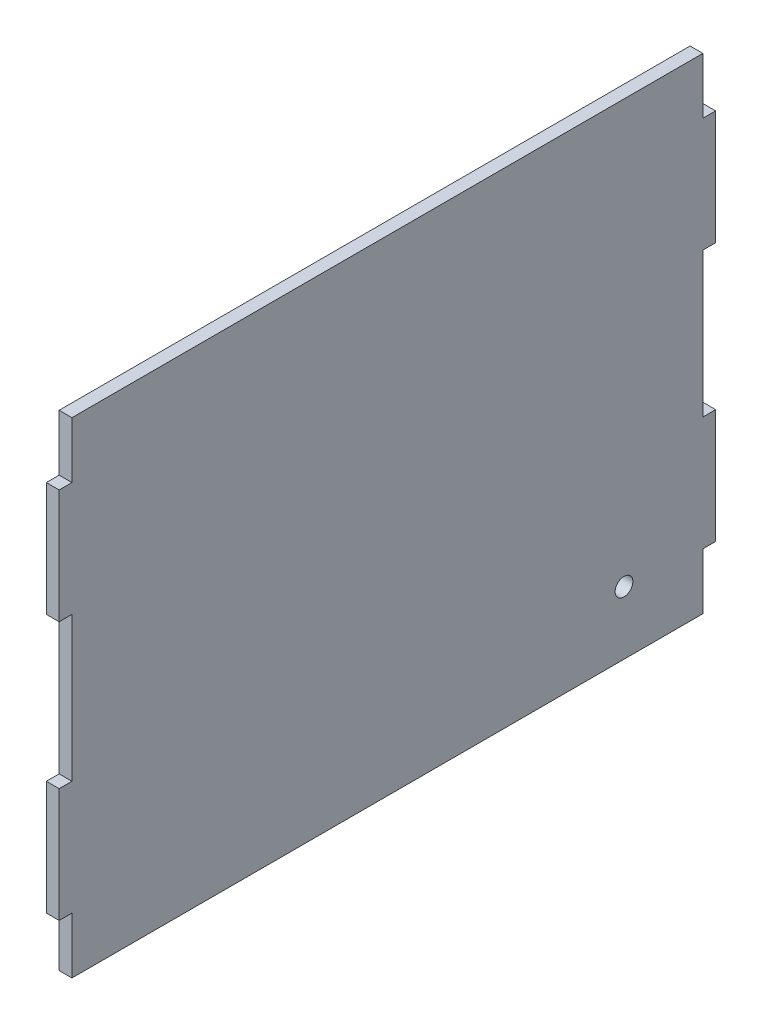
ISO-10303-21;
HEADER;
FILE_DESCRIPTION(('STEP AP214'),'2;1');
FILE_NAME('part.step','',(''),(''),'','','');
FILE_SCHEMA(('AUTOMOTIVE_DESIGN { 1 0 10303 214 1 1 1 1 }'));
ENDSEC;
DATA;
#1=APPLICATION_CONTEXT('core data for automotive mechanical design processes');
#2=APPLICATION_PROTOCOL_DEFINITION('international standard','automotive_design',2000,#1);
#3=PRODUCT_CONTEXT('',#1,'mechanical');
#4=PRODUCT('Part','Part','',(#3));
#5=PRODUCT_RELATED_PRODUCT_CATEGORY('part','',(#4));
#6=PRODUCT_DEFINITION_FORMATION('','',#4);
#7=PRODUCT_DEFINITION_CONTEXT('part definition',#1,'design');
#8=PRODUCT_DEFINITION('design','',#6,#7);
#9=PRODUCT_DEFINITION_SHAPE('','',#8);
#10=(LENGTH_UNIT() NAMED_UNIT(*) SI_UNIT(.MILLI.,.METRE.));
#11=(NAMED_UNIT(*) PLANE_ANGLE_UNIT() SI_UNIT($,.RADIAN.));
#12=(NAMED_UNIT(*) SI_UNIT($,.STERADIAN.) SOLID_ANGLE_UNIT());
#13=UNCERTAINTY_MEASURE_WITH_UNIT(LENGTH_MEASURE(1.E-05),#10,'distance_accuracy_value','');
#14=(GEOMETRIC_REPRESENTATION_CONTEXT(3) GLOBAL_UNCERTAINTY_ASSIGNED_CONTEXT((#13)) GLOBAL_UNIT_ASSIGNED_CONTEXT((#10,
#11,#12)) REPRESENTATION_CONTEXT('',''));
#15=CARTESIAN_POINT('',(0.,0.,0.));
#16=DIRECTION('',(0.,0.,1.));
#17=DIRECTION('',(1.,0.,0.));
#18=AXIS2_PLACEMENT_3D('',#15,#16,#17);
#19=CARTESIAN_POINT('',(5.7,-32.1500000000001,-140.35));
#20=DIRECTION('',(0.,-1.,0.));
#21=DIRECTION('',(0.,0.,-1.));
#22=AXIS2_PLACEMENT_3D('',#19,#20,#21);
#23=PLANE('',#22);
#24=DIRECTION('',(0.,0.,1.));
#25=VECTOR('',#24,1.);
#26=CARTESIAN_POINT('',(0.,-32.1500000000001,-140.35));
#27=LINE('',#26,#25);
#28=CARTESIAN_POINT('',(0.,-32.1500000000001,-146.05));
#29=VERTEX_POINT('',#28);
#30=CARTESIAN_POINT('',(0.,-32.1500000000001,-140.35));
#31=VERTEX_POINT('',#30);
#32=EDGE_CURVE('E216',#29,#31,#27,.T.);
#33=ORIENTED_EDGE('',*,*,#32,.T.);
#34=DIRECTION('',(-1.,0.,0.));
#35=VECTOR('',#34,1.);
#36=CARTESIAN_POINT('',(5.7,-32.1500000000001,-140.35));
#37=LINE('',#36,#35);
#38=CARTESIAN_POINT('',(5.7,-32.1500000000001,-140.35));
#39=VERTEX_POINT('',#38);
#40=EDGE_CURVE('E11',#39,#31,#37,.T.);
#41=ORIENTED_EDGE('',*,*,#40,.F.);
#42=DIRECTION('',(0.,0.,1.));
#43=VECTOR('',#42,1.);
#44=CARTESIAN_POINT('',(5.7,-32.1500000000001,-140.35));
#45=LINE('',#44,#43);
#46=CARTESIAN_POINT('',(5.7,-32.1500000000001,-146.05));
#47=VERTEX_POINT('',#46);
#48=EDGE_CURVE('E274',#47,#39,#45,.T.);
#49=ORIENTED_EDGE('',*,*,#48,.F.);
#50=DIRECTION('',(-1.,0.,0.));
#51=VECTOR('',#50,1.);
#52=CARTESIAN_POINT('',(5.7,-32.1500000000001,-146.05));
#53=LINE('',#52,#51);
#54=EDGE_CURVE('E212',#47,#29,#53,.T.);
#55=ORIENTED_EDGE('',*,*,#54,.T.);
#56=EDGE_LOOP('',(#33,#41,#49,#55));
#57=FACE_BOUND('',#56,.T.);
#58=ADVANCED_FACE('F42',(#57),#23,.F.);
#59=CARTESIAN_POINT('',(5.7,32.15,-140.35));
#60=DIRECTION('',(0.,0.,1.));
#61=DIRECTION('',(1.,0.,0.));
#62=AXIS2_PLACEMENT_3D('',#59,#60,#61);
#63=PLANE('',#62);
#64=DIRECTION('',(0.,1.,0.));
#65=VECTOR('',#64,1.);
#66=CARTESIAN_POINT('',(0.,32.15,-140.35));
#67=LINE('',#66,#65);
#68=CARTESIAN_POINT('',(0.,32.15,-140.35));
#69=VERTEX_POINT('',#68);
#70=EDGE_CURVE('E220',#31,#69,#67,.T.);
#71=ORIENTED_EDGE('',*,*,#70,.T.);
#72=DIRECTION('',(-1.,0.,0.));
#73=VECTOR('',#72,1.);
#74=CARTESIAN_POINT('',(5.7,32.15,-140.35));
#75=LINE('',#74,#73);
#76=CARTESIAN_POINT('',(5.7,32.15,-140.35));
#77=VERTEX_POINT('',#76);
#78=EDGE_CURVE('E52',#77,#69,#75,.T.);
#79=ORIENTED_EDGE('',*,*,#78,.F.);
#80=DIRECTION('',(0.,1.,0.));
#81=VECTOR('',#80,1.);
#82=CARTESIAN_POINT('',(5.7,32.15,-140.35));
#83=LINE('',#82,#81);
#84=EDGE_CURVE('E139',#39,#77,#83,.T.);
#85=ORIENTED_EDGE('',*,*,#84,.F.);
#86=ORIENTED_EDGE('',*,*,#40,.T.);
#87=EDGE_LOOP('',(#71,#79,#85,#86));
#88=FACE_BOUND('',#87,.T.);
#89=ADVANCED_FACE('F427',(#88),#63,.F.);
#90=CARTESIAN_POINT('',(5.7,32.15,-140.35));
#91=DIRECTION('',(0.,1.,0.));
#92=DIRECTION('',(0.,0.,1.));
#93=AXIS2_PLACEMENT_3D('',#90,#91,#92);
#94=PLANE('',#93);
#95=DIRECTION('',(0.,0.,-1.));
#96=VECTOR('',#95,1.);
#97=CARTESIAN_POINT('',(0.,32.15,-140.35));
#98=LINE('',#97,#96);
#99=CARTESIAN_POINT('',(0.,32.15,-146.05));
#100=VERTEX_POINT('',#99);
#101=EDGE_CURVE('E223',#69,#100,#98,.T.);
#102=ORIENTED_EDGE('',*,*,#101,.T.);
#103=DIRECTION('',(-1.,0.,0.));
#104=VECTOR('',#103,1.);
#105=CARTESIAN_POINT('',(5.7,32.15,-146.05));
#106=LINE('',#105,#104);
#107=CARTESIAN_POINT('',(5.7,32.15,-146.05));
#108=VERTEX_POINT('',#107);
#109=EDGE_CURVE('E333',#108,#100,#106,.T.);
#110=ORIENTED_EDGE('',*,*,#109,.F.);
#111=DIRECTION('',(0.,0.,-1.));
#112=VECTOR('',#111,1.);
#113=CARTESIAN_POINT('',(5.7,32.15,-140.35));
#114=LINE('',#113,#112);
#115=EDGE_CURVE('E344',#77,#108,#114,.T.);
#116=ORIENTED_EDGE('',*,*,#115,.F.);
#117=ORIENTED_EDGE('',*,*,#78,.T.);
#118=EDGE_LOOP('',(#102,#110,#116,#117));
#119=FACE_BOUND('',#118,.T.);
#120=ADVANCED_FACE('F342',(#119),#94,.F.);
#121=CARTESIAN_POINT('',(5.7,82.9499999999999,-146.05));
#122=DIRECTION('',(0.,0.,1.));
#123=DIRECTION('',(0.,-1.,0.));
#124=AXIS2_PLACEMENT_3D('',#121,#122,#123);
#125=PLANE('',#124);
#126=DIRECTION('',(0.,1.,0.));
#127=VECTOR('',#126,1.);
#128=CARTESIAN_POINT('',(0.,82.9499999999999,-146.05));
#129=LINE('',#128,#127);
#130=CARTESIAN_POINT('',(0.,82.9499999999999,-146.05));
#131=VERTEX_POINT('',#130);
#132=EDGE_CURVE('E226',#100,#131,#129,.T.);
#133=ORIENTED_EDGE('',*,*,#132,.T.);
#134=DIRECTION('',(-1.,0.,0.));
#135=VECTOR('',#134,1.);
#136=CARTESIAN_POINT('',(5.7,82.9499999999999,-146.05));
#137=LINE('',#136,#135);
#138=CARTESIAN_POINT('',(5.7,82.9499999999999,-146.05));
#139=VERTEX_POINT('',#138);
#140=EDGE_CURVE('E329',#139,#131,#137,.T.);
#141=ORIENTED_EDGE('',*,*,#140,.F.);
#142=DIRECTION('',(0.,1.,0.));
#143=VECTOR('',#142,1.);
#144=CARTESIAN_POINT('',(5.7,82.9499999999999,-146.05));
#145=LINE('',#144,#143);
#146=EDGE_CURVE('E363',#108,#139,#145,.T.);
#147=ORIENTED_EDGE('',*,*,#146,.F.);
#148=ORIENTED_EDGE('',*,*,#109,.T.);
#149=EDGE_LOOP('',(#133,#141,#147,#148));
#150=FACE_BOUND('',#149,.T.);
#151=ADVANCED_FACE('F353',(#150),#125,.F.);
#152=CARTESIAN_POINT('',(5.7,82.9499999999999,-146.05));
#153=DIRECTION('',(0.,-1.,0.));
#154=DIRECTION('',(0.,0.,-1.));
#155=AXIS2_PLACEMENT_3D('',#152,#153,#154);
#156=PLANE('',#155);
#157=DIRECTION('',(0.,0.,1.));
#158=VECTOR('',#157,1.);
#159=CARTESIAN_POINT('',(0.,82.9499999999999,-146.05));
#160=LINE('',#159,#158);
#161=CARTESIAN_POINT('',(0.,82.95,-140.35));
#162=VERTEX_POINT('',#161);
#163=EDGE_CURVE('E229',#131,#162,#160,.T.);
#164=ORIENTED_EDGE('',*,*,#163,.T.);
#165=DIRECTION('',(-1.,0.,0.));
#166=VECTOR('',#165,1.);
#167=CARTESIAN_POINT('',(5.7,82.95,-140.35));
#168=LINE('',#167,#166);
#169=CARTESIAN_POINT('',(5.7,82.95,-140.35));
#170=VERTEX_POINT('',#169);
#171=EDGE_CURVE('E325',#170,#162,#168,.T.);
#172=ORIENTED_EDGE('',*,*,#171,.F.);
#173=DIRECTION('',(0.,0.,1.));
#174=VECTOR('',#173,1.);
#175=CARTESIAN_POINT('',(5.7,82.9499999999999,-146.05));
#176=LINE('',#175,#174);
#177=EDGE_CURVE('E359',#139,#170,#176,.T.);
#178=ORIENTED_EDGE('',*,*,#177,.F.);
#179=ORIENTED_EDGE('',*,*,#140,.T.);
#180=EDGE_LOOP('',(#164,#172,#178,#179));
#181=FACE_BOUND('',#180,.T.);
#182=ADVANCED_FACE('F357',(#181),#156,.F.);
#183=CARTESIAN_POINT('',(5.7,82.95,-140.35));
#184=DIRECTION('',(0.,0.,1.));
#185=DIRECTION('',(1.,0.,0.));
#186=AXIS2_PLACEMENT_3D('',#183,#184,#185);
#187=PLANE('',#186);
#188=DIRECTION('',(0.,1.,0.));
#189=VECTOR('',#188,1.);
#190=CARTESIAN_POINT('',(0.,82.95,-140.35));
#191=LINE('',#190,#189);
#192=CARTESIAN_POINT('',(0.,107.95,-140.35));
#193=VERTEX_POINT('',#192);
#194=EDGE_CURVE('E232',#162,#193,#191,.T.);
#195=ORIENTED_EDGE('',*,*,#194,.T.);
#196=DIRECTION('',(-1.,0.,0.));
#197=VECTOR('',#196,1.);
#198=CARTESIAN_POINT('',(5.7,107.95,-140.35));
#199=LINE('',#198,#197);
#200=CARTESIAN_POINT('',(5.7,107.95,-140.35));
#201=VERTEX_POINT('',#200);
#202=EDGE_CURVE('E321',#201,#193,#199,.T.);
#203=ORIENTED_EDGE('',*,*,#202,.F.);
#204=DIRECTION('',(0.,1.,0.));
#205=VECTOR('',#204,1.);
#206=CARTESIAN_POINT('',(5.7,82.95,-140.35));
#207=LINE('',#206,#205);
#208=EDGE_CURVE('E362',#170,#201,#207,.T.);
#209=ORIENTED_EDGE('',*,*,#208,.F.);
#210=ORIENTED_EDGE('',*,*,#171,.T.);
#211=EDGE_LOOP('',(#195,#203,#209,#210));
#212=FACE_BOUND('',#211,.T.);
#213=ADVANCED_FACE('F440',(#212),#187,.F.);
#214=CARTESIAN_POINT('',(5.7,107.95,140.35));
#215=DIRECTION('',(0.,-1.,0.));
#216=DIRECTION('',(0.,0.,-1.));
#217=AXIS2_PLACEMENT_3D('',#214,#215,#216);
#218=PLANE('',#217);
#219=DIRECTION('',(0.,0.,1.));
#220=VECTOR('',#219,1.);
#221=CARTESIAN_POINT('',(0.,107.95,140.35));
#222=LINE('',#221,#220);
#223=CARTESIAN_POINT('',(0.,107.95,140.35));
#224=VERTEX_POINT('',#223);
#225=EDGE_CURVE('E235',#193,#224,#222,.T.);
#226=ORIENTED_EDGE('',*,*,#225,.T.);
#227=DIRECTION('',(-1.,0.,0.));
#228=VECTOR('',#227,1.);
#229=CARTESIAN_POINT('',(5.7,107.95,140.35));
#230=LINE('',#229,#228);
#231=CARTESIAN_POINT('',(5.7,107.95,140.35));
#232=VERTEX_POINT('',#231);
#233=EDGE_CURVE('E317',#232,#224,#230,.T.);
#234=ORIENTED_EDGE('',*,*,#233,.F.);
#235=DIRECTION('',(0.,0.,1.));
#236=VECTOR('',#235,1.);
#237=CARTESIAN_POINT('',(5.7,107.95,140.35));
#238=LINE('',#237,#236);
#239=EDGE_CURVE('E367',#201,#232,#238,.T.);
#240=ORIENTED_EDGE('',*,*,#239,.F.);
#241=ORIENTED_EDGE('',*,*,#202,.T.);
#242=EDGE_LOOP('',(#226,#234,#240,#241));
#243=FACE_BOUND('',#242,.T.);
#244=ADVANCED_FACE('F443',(#243),#218,.F.);
#245=CARTESIAN_POINT('',(5.7,82.95,140.35));
#246=DIRECTION('',(0.,0.,-1.));
#247=DIRECTION('',(-1.,0.,0.));
#248=AXIS2_PLACEMENT_3D('',#245,#246,#247);
#249=PLANE('',#248);
#250=DIRECTION('',(0.,-1.,0.));
#251=VECTOR('',#250,1.);
#252=CARTESIAN_POINT('',(0.,82.95,140.35));
#253=LINE('',#252,#251);
#254=CARTESIAN_POINT('',(0.,82.95,140.35));
#255=VERTEX_POINT('',#254);
#256=EDGE_CURVE('E238',#224,#255,#253,.T.);
#257=ORIENTED_EDGE('',*,*,#256,.T.);
#258=DIRECTION('',(-1.,0.,0.));
#259=VECTOR('',#258,1.);
#260=CARTESIAN_POINT('',(5.7,82.95,140.35));
#261=LINE('',#260,#259);
#262=CARTESIAN_POINT('',(5.7,82.95,140.35));
#263=VERTEX_POINT('',#262);
#264=EDGE_CURVE('E313',#263,#255,#261,.T.);
#265=ORIENTED_EDGE('',*,*,#264,.F.);
#266=DIRECTION('',(0.,-1.,0.));
#267=VECTOR('',#266,1.);
#268=CARTESIAN_POINT('',(5.7,82.95,140.35));
#269=LINE('',#268,#267);
#270=EDGE_CURVE('E374',#232,#263,#269,.T.);
#271=ORIENTED_EDGE('',*,*,#270,.F.);
#272=ORIENTED_EDGE('',*,*,#233,.T.);
#273=EDGE_LOOP('',(#257,#265,#271,#272));
#274=FACE_BOUND('',#273,.T.);
#275=ADVANCED_FACE('F447',(#274),#249,.F.);
#276=CARTESIAN_POINT('',(5.7,82.95,146.05));
#277=DIRECTION('',(0.,-1.,0.));
#278=DIRECTION('',(0.,0.,-1.));
#279=AXIS2_PLACEMENT_3D('',#276,#277,#278);
#280=PLANE('',#279);
#281=DIRECTION('',(0.,0.,1.));
#282=VECTOR('',#281,1.);
#283=CARTESIAN_POINT('',(0.,82.95,146.05));
#284=LINE('',#283,#282);
#285=CARTESIAN_POINT('',(0.,82.95,146.05));
#286=VERTEX_POINT('',#285);
#287=EDGE_CURVE('E241',#255,#286,#284,.T.);
#288=ORIENTED_EDGE('',*,*,#287,.T.);
#289=DIRECTION('',(-1.,0.,0.));
#290=VECTOR('',#289,1.);
#291=CARTESIAN_POINT('',(5.7,82.95,146.05));
#292=LINE('',#291,#290);
#293=CARTESIAN_POINT('',(5.7,82.95,146.05));
#294=VERTEX_POINT('',#293);
#295=EDGE_CURVE('E309',#294,#286,#292,.T.);
#296=ORIENTED_EDGE('',*,*,#295,.F.);
#297=DIRECTION('',(0.,0.,1.));
#298=VECTOR('',#297,1.);
#299=CARTESIAN_POINT('',(5.7,82.95,146.05));
#300=LINE('',#299,#298);
#301=EDGE_CURVE('E377',#263,#294,#300,.T.);
#302=ORIENTED_EDGE('',*,*,#301,.F.);
#303=ORIENTED_EDGE('',*,*,#264,.T.);
#304=EDGE_LOOP('',(#288,#296,#302,#303));
#305=FACE_BOUND('',#304,.T.);
#306=ADVANCED_FACE('F451',(#305),#280,.F.);
#307=CARTESIAN_POINT('',(5.7,82.95,146.05));
#308=DIRECTION('',(0.,0.,-1.));
#309=DIRECTION('',(0.,1.,0.));
#310=AXIS2_PLACEMENT_3D('',#307,#308,#309);
#311=PLANE('',#310);
#312=DIRECTION('',(0.,-1.,0.));
#313=VECTOR('',#312,1.);
#314=CARTESIAN_POINT('',(0.,82.95,146.05));
#315=LINE('',#314,#313);
#316=CARTESIAN_POINT('',(0.,32.15,146.05));
#317=VERTEX_POINT('',#316);
#318=EDGE_CURVE('E244',#286,#317,#315,.T.);
#319=ORIENTED_EDGE('',*,*,#318,.T.);
#320=DIRECTION('',(-1.,0.,0.));
#321=VECTOR('',#320,1.);
#322=CARTESIAN_POINT('',(5.7,32.15,146.05));
#323=LINE('',#322,#321);
#324=CARTESIAN_POINT('',(5.7,32.15,146.05));
#325=VERTEX_POINT('',#324);
#326=EDGE_CURVE('E305',#325,#317,#323,.T.);
#327=ORIENTED_EDGE('',*,*,#326,.F.);
#328=DIRECTION('',(0.,-1.,0.));
#329=VECTOR('',#328,1.);
#330=CARTESIAN_POINT('',(5.7,82.95,146.05));
#331=LINE('',#330,#329);
#332=EDGE_CURVE('E380',#294,#325,#331,.T.);
#333=ORIENTED_EDGE('',*,*,#332,.F.);
#334=ORIENTED_EDGE('',*,*,#295,.T.);
#335=EDGE_LOOP('',(#319,#327,#333,#334));
#336=FACE_BOUND('',#335,.T.);
#337=ADVANCED_FACE('F455',(#336),#311,.F.);
#338=CARTESIAN_POINT('',(5.7,32.15,140.35));
#339=DIRECTION('',(0.,1.,0.));
#340=DIRECTION('',(0.,0.,1.));
#341=AXIS2_PLACEMENT_3D('',#338,#339,#340);
#342=PLANE('',#341);
#343=DIRECTION('',(0.,0.,-1.));
#344=VECTOR('',#343,1.);
#345=CARTESIAN_POINT('',(0.,32.15,140.35));
#346=LINE('',#345,#344);
#347=CARTESIAN_POINT('',(0.,32.15,140.35));
#348=VERTEX_POINT('',#347);
#349=EDGE_CURVE('E247',#317,#348,#346,.T.);
#350=ORIENTED_EDGE('',*,*,#349,.T.);
#351=DIRECTION('',(-1.,0.,0.));
#352=VECTOR('',#351,1.);
#353=CARTESIAN_POINT('',(5.7,32.15,140.35));
#354=LINE('',#353,#352);
#355=CARTESIAN_POINT('',(5.7,32.15,140.35));
#356=VERTEX_POINT('',#355);
#357=EDGE_CURVE('E301',#356,#348,#354,.T.);
#358=ORIENTED_EDGE('',*,*,#357,.F.);
#359=DIRECTION('',(0.,0.,-1.));
#360=VECTOR('',#359,1.);
#361=CARTESIAN_POINT('',(5.7,32.15,140.35));
#362=LINE('',#361,#360);
#363=EDGE_CURVE('E383',#325,#356,#362,.T.);
#364=ORIENTED_EDGE('',*,*,#363,.F.);
#365=ORIENTED_EDGE('',*,*,#326,.T.);
#366=EDGE_LOOP('',(#350,#358,#364,#365));
#367=FACE_BOUND('',#366,.T.);
#368=ADVANCED_FACE('F459',(#367),#342,.F.);
#369=CARTESIAN_POINT('',(5.7,32.15,140.35));
#370=DIRECTION('',(0.,0.,-1.));
#371=DIRECTION('',(-1.,0.,0.));
#372=AXIS2_PLACEMENT_3D('',#369,#370,#371);
#373=PLANE('',#372);
#374=DIRECTION('',(0.,-1.,0.));
#375=VECTOR('',#374,1.);
#376=CARTESIAN_POINT('',(0.,32.15,140.35));
#377=LINE('',#376,#375);
#378=CARTESIAN_POINT('',(0.,-32.15,140.35));
#379=VERTEX_POINT('',#378);
#380=EDGE_CURVE('E250',#348,#379,#377,.T.);
#381=ORIENTED_EDGE('',*,*,#380,.T.);
#382=DIRECTION('',(-1.,0.,0.));
#383=VECTOR('',#382,1.);
#384=CARTESIAN_POINT('',(5.7,-32.15,140.35));
#385=LINE('',#384,#383);
#386=CARTESIAN_POINT('',(5.7,-32.15,140.35));
#387=VERTEX_POINT('',#386);
#388=EDGE_CURVE('E297',#387,#379,#385,.T.);
#389=ORIENTED_EDGE('',*,*,#388,.F.);
#390=DIRECTION('',(0.,-1.,0.));
#391=VECTOR('',#390,1.);
#392=CARTESIAN_POINT('',(5.7,32.15,140.35));
#393=LINE('',#392,#391);
#394=EDGE_CURVE('E386',#356,#387,#393,.T.);
#395=ORIENTED_EDGE('',*,*,#394,.F.);
#396=ORIENTED_EDGE('',*,*,#357,.T.);
#397=EDGE_LOOP('',(#381,#389,#395,#396));
#398=FACE_BOUND('',#397,.T.);
#399=ADVANCED_FACE('F463',(#398),#373,.F.);
#400=CARTESIAN_POINT('',(5.7,-32.15,140.35));
#401=DIRECTION('',(0.,-1.,0.));
#402=DIRECTION('',(0.,0.,-1.));
#403=AXIS2_PLACEMENT_3D('',#400,#401,#402);
#404=PLANE('',#403);
#405=DIRECTION('',(0.,0.,1.));
#406=VECTOR('',#405,1.);
#407=CARTESIAN_POINT('',(0.,-32.15,140.35));
#408=LINE('',#407,#406);
#409=CARTESIAN_POINT('',(0.,-32.15,146.05));
#410=VERTEX_POINT('',#409);
#411=EDGE_CURVE('E253',#379,#410,#408,.T.);
#412=ORIENTED_EDGE('',*,*,#411,.T.);
#413=DIRECTION('',(-1.,0.,0.));
#414=VECTOR('',#413,1.);
#415=CARTESIAN_POINT('',(5.7,-32.15,146.05));
#416=LINE('',#415,#414);
#417=CARTESIAN_POINT('',(5.7,-32.15,146.05));
#418=VERTEX_POINT('',#417);
#419=EDGE_CURVE('E293',#418,#410,#416,.T.);
#420=ORIENTED_EDGE('',*,*,#419,.F.);
#421=DIRECTION('',(0.,0.,1.));
#422=VECTOR('',#421,1.);
#423=CARTESIAN_POINT('',(5.7,-32.15,140.35));
#424=LINE('',#423,#422);
#425=EDGE_CURVE('E389',#387,#418,#424,.T.);
#426=ORIENTED_EDGE('',*,*,#425,.F.);
#427=ORIENTED_EDGE('',*,*,#388,.T.);
#428=EDGE_LOOP('',(#412,#420,#426,#427));
#429=FACE_BOUND('',#428,.T.);
#430=ADVANCED_FACE('F467',(#429),#404,.F.);
#431=CARTESIAN_POINT('',(5.7,-32.15,146.05));
#432=DIRECTION('',(0.,0.,-1.));
#433=DIRECTION('',(0.,1.,0.));
#434=AXIS2_PLACEMENT_3D('',#431,#432,#433);
#435=PLANE('',#434);
#436=DIRECTION('',(0.,-1.,0.));
#437=VECTOR('',#436,1.);
#438=CARTESIAN_POINT('',(0.,-32.15,146.05));
#439=LINE('',#438,#437);
#440=CARTESIAN_POINT('',(0.,-82.95,146.05));
#441=VERTEX_POINT('',#440);
#442=EDGE_CURVE('E256',#410,#441,#439,.T.);
#443=ORIENTED_EDGE('',*,*,#442,.T.);
#444=DIRECTION('',(-1.,0.,0.));
#445=VECTOR('',#444,1.);
#446=CARTESIAN_POINT('',(5.7,-82.95,146.05));
#447=LINE('',#446,#445);
#448=CARTESIAN_POINT('',(5.7,-82.95,146.05));
#449=VERTEX_POINT('',#448);
#450=EDGE_CURVE('E289',#449,#441,#447,.T.);
#451=ORIENTED_EDGE('',*,*,#450,.F.);
#452=DIRECTION('',(0.,-1.,0.));
#453=VECTOR('',#452,1.);
#454=CARTESIAN_POINT('',(5.7,-32.15,146.05));
#455=LINE('',#454,#453);
#456=EDGE_CURVE('E392',#418,#449,#455,.T.);
#457=ORIENTED_EDGE('',*,*,#456,.F.);
#458=ORIENTED_EDGE('',*,*,#419,.T.);
#459=EDGE_LOOP('',(#443,#451,#457,#458));
#460=FACE_BOUND('',#459,.T.);
#461=ADVANCED_FACE('F471',(#460),#435,.F.);
#462=CARTESIAN_POINT('',(5.7,-82.95,146.05));
#463=DIRECTION('',(0.,1.,0.));
#464=DIRECTION('',(0.,0.,1.));
#465=AXIS2_PLACEMENT_3D('',#462,#463,#464);
#466=PLANE('',#465);
#467=DIRECTION('',(0.,0.,-1.));
#468=VECTOR('',#467,1.);
#469=CARTESIAN_POINT('',(0.,-82.95,146.05));
#470=LINE('',#469,#468);
#471=CARTESIAN_POINT('',(0.,-82.95,140.35));
#472=VERTEX_POINT('',#471);
#473=EDGE_CURVE('E259',#441,#472,#470,.T.);
#474=ORIENTED_EDGE('',*,*,#473,.T.);
#475=DIRECTION('',(-1.,0.,0.));
#476=VECTOR('',#475,1.);
#477=CARTESIAN_POINT('',(5.7,-82.95,140.35));
#478=LINE('',#477,#476);
#479=CARTESIAN_POINT('',(5.7,-82.95,140.35));
#480=VERTEX_POINT('',#479);
#481=EDGE_CURVE('E285',#480,#472,#478,.T.);
#482=ORIENTED_EDGE('',*,*,#481,.F.);
#483=DIRECTION('',(0.,0.,-1.));
#484=VECTOR('',#483,1.);
#485=CARTESIAN_POINT('',(5.7,-82.95,146.05));
#486=LINE('',#485,#484);
#487=EDGE_CURVE('E395',#449,#480,#486,.T.);
#488=ORIENTED_EDGE('',*,*,#487,.F.);
#489=ORIENTED_EDGE('',*,*,#450,.T.);
#490=EDGE_LOOP('',(#474,#482,#488,#489));
#491=FACE_BOUND('',#490,.T.);
#492=ADVANCED_FACE('F475',(#491),#466,.F.);
#493=CARTESIAN_POINT('',(5.7,-82.95,140.35));
#494=DIRECTION('',(0.,0.,-1.));
#495=DIRECTION('',(-1.,0.,0.));
#496=AXIS2_PLACEMENT_3D('',#493,#494,#495);
#497=PLANE('',#496);
#498=DIRECTION('',(0.,-1.,0.));
#499=VECTOR('',#498,1.);
#500=CARTESIAN_POINT('',(0.,-82.95,140.35));
#501=LINE('',#500,#499);
#502=CARTESIAN_POINT('',(0.,-107.95,140.35));
#503=VERTEX_POINT('',#502);
#504=EDGE_CURVE('E262',#472,#503,#501,.T.);
#505=ORIENTED_EDGE('',*,*,#504,.T.);
#506=DIRECTION('',(-1.,0.,0.));
#507=VECTOR('',#506,1.);
#508=CARTESIAN_POINT('',(5.7,-107.95,140.35));
#509=LINE('',#508,#507);
#510=CARTESIAN_POINT('',(5.7,-107.95,140.35));
#511=VERTEX_POINT('',#510);
#512=EDGE_CURVE('E281',#511,#503,#509,.T.);
#513=ORIENTED_EDGE('',*,*,#512,.F.);
#514=DIRECTION('',(0.,-1.,0.));
#515=VECTOR('',#514,1.);
#516=CARTESIAN_POINT('',(5.7,-82.95,140.35));
#517=LINE('',#516,#515);
#518=EDGE_CURVE('E398',#480,#511,#517,.T.);
#519=ORIENTED_EDGE('',*,*,#518,.F.);
#520=ORIENTED_EDGE('',*,*,#481,.T.);
#521=EDGE_LOOP('',(#505,#513,#519,#520));
#522=FACE_BOUND('',#521,.T.);
#523=ADVANCED_FACE('F406',(#522),#497,.F.);
#524=CARTESIAN_POINT('',(5.7,-107.95,140.35));
#525=DIRECTION('',(0.,1.,0.));
#526=DIRECTION('',(0.,0.,1.));
#527=AXIS2_PLACEMENT_3D('',#524,#525,#526);
#528=PLANE('',#527);
#529=DIRECTION('',(0.,0.,-1.));
#530=VECTOR('',#529,1.);
#531=CARTESIAN_POINT('',(0.,-107.95,140.35));
#532=LINE('',#531,#530);
#533=CARTESIAN_POINT('',(0.,-107.95,-140.35));
#534=VERTEX_POINT('',#533);
#535=EDGE_CURVE('E265',#503,#534,#532,.T.);
#536=ORIENTED_EDGE('',*,*,#535,.T.);
#537=DIRECTION('',(-1.,0.,0.));
#538=VECTOR('',#537,1.);
#539=CARTESIAN_POINT('',(5.7,-107.95,-140.35));
#540=LINE('',#539,#538);
#541=CARTESIAN_POINT('',(5.7,-107.95,-140.35));
#542=VERTEX_POINT('',#541);
#543=EDGE_CURVE('E205',#542,#534,#540,.T.);
#544=ORIENTED_EDGE('',*,*,#543,.F.);
#545=DIRECTION('',(0.,0.,-1.));
#546=VECTOR('',#545,1.);
#547=CARTESIAN_POINT('',(5.7,-107.95,140.35));
#548=LINE('',#547,#546);
#549=EDGE_CURVE('E194',#511,#542,#548,.T.);
#550=ORIENTED_EDGE('',*,*,#549,.F.);
#551=ORIENTED_EDGE('',*,*,#512,.T.);
#552=EDGE_LOOP('',(#536,#544,#550,#551));
#553=FACE_BOUND('',#552,.T.);
#554=ADVANCED_FACE('F410',(#553),#528,.F.);
#555=CARTESIAN_POINT('',(5.7,-82.9500000000001,-140.35));
#556=DIRECTION('',(0.,0.,1.));
#557=DIRECTION('',(1.,0.,0.));
#558=AXIS2_PLACEMENT_3D('',#555,#556,#557);
#559=PLANE('',#558);
#560=DIRECTION('',(0.,1.,0.));
#561=VECTOR('',#560,1.);
#562=CARTESIAN_POINT('',(0.,-82.9500000000001,-140.35));
#563=LINE('',#562,#561);
#564=CARTESIAN_POINT('',(0.,-82.9500000000001,-140.35));
#565=VERTEX_POINT('',#564);
#566=EDGE_CURVE('E203',#534,#565,#563,.T.);
#567=ORIENTED_EDGE('',*,*,#566,.T.);
#568=DIRECTION('',(-1.,0.,0.));
#569=VECTOR('',#568,1.);
#570=CARTESIAN_POINT('',(5.7,-82.9500000000001,-140.35));
#571=LINE('',#570,#569);
#572=CARTESIAN_POINT('',(5.7,-82.9500000000001,-140.35));
#573=VERTEX_POINT('',#572);
#574=EDGE_CURVE('E200',#573,#565,#571,.T.);
#575=ORIENTED_EDGE('',*,*,#574,.F.);
#576=DIRECTION('',(0.,1.,0.));
#577=VECTOR('',#576,1.);
#578=CARTESIAN_POINT('',(5.7,-82.9500000000001,-140.35));
#579=LINE('',#578,#577);
#580=EDGE_CURVE('E188',#542,#573,#579,.T.);
#581=ORIENTED_EDGE('',*,*,#580,.F.);
#582=ORIENTED_EDGE('',*,*,#543,.T.);
#583=EDGE_LOOP('',(#567,#575,#581,#582));
#584=FACE_BOUND('',#583,.T.);
#585=ADVANCED_FACE('F201',(#584),#559,.F.);
#586=CARTESIAN_POINT('',(5.7,-82.9500000000001,-146.05));
#587=DIRECTION('',(0.,1.,0.));
#588=DIRECTION('',(0.,0.,1.));
#589=AXIS2_PLACEMENT_3D('',#586,#587,#588);
#590=PLANE('',#589);
#591=DIRECTION('',(0.,0.,-1.));
#592=VECTOR('',#591,1.);
#593=CARTESIAN_POINT('',(0.,-82.9500000000001,-146.05));
#594=LINE('',#593,#592);
#595=CARTESIAN_POINT('',(0.,-82.9500000000001,-146.05));
#596=VERTEX_POINT('',#595);
#597=EDGE_CURVE('E125',#565,#596,#594,.T.);
#598=ORIENTED_EDGE('',*,*,#597,.T.);
#599=DIRECTION('',(-1.,0.,0.));
#600=VECTOR('',#599,1.);
#601=CARTESIAN_POINT('',(5.7,-82.9500000000001,-146.05));
#602=LINE('',#601,#600);
#603=CARTESIAN_POINT('',(5.7,-82.9500000000001,-146.05));
#604=VERTEX_POINT('',#603);
#605=EDGE_CURVE('E206',#604,#596,#602,.T.);
#606=ORIENTED_EDGE('',*,*,#605,.F.);
#607=DIRECTION('',(0.,0.,-1.));
#608=VECTOR('',#607,1.);
#609=CARTESIAN_POINT('',(5.7,-82.9500000000001,-146.05));
#610=LINE('',#609,#608);
#611=EDGE_CURVE('E192',#573,#604,#610,.T.);
#612=ORIENTED_EDGE('',*,*,#611,.F.);
#613=ORIENTED_EDGE('',*,*,#574,.T.);
#614=EDGE_LOOP('',(#598,#606,#612,#613));
#615=FACE_BOUND('',#614,.T.);
#616=ADVANCED_FACE('F208',(#615),#590,.F.);
#617=CARTESIAN_POINT('',(5.7,-32.1500000000001,-146.05));
#618=DIRECTION('',(0.,0.,1.));
#619=DIRECTION('',(1.,0.,0.));
#620=AXIS2_PLACEMENT_3D('',#617,#618,#619);
#621=PLANE('',#620);
#622=DIRECTION('',(0.,1.,0.));
#623=VECTOR('',#622,1.);
#624=CARTESIAN_POINT('',(0.,-32.1500000000001,-146.05));
#625=LINE('',#624,#623);
#626=EDGE_CURVE('E131',#596,#29,#625,.T.);
#627=ORIENTED_EDGE('',*,*,#626,.T.);
#628=ORIENTED_EDGE('',*,*,#54,.F.);
#629=DIRECTION('',(0.,1.,0.));
#630=VECTOR('',#629,1.);
#631=CARTESIAN_POINT('',(5.7,-32.1500000000001,-146.05));
#632=LINE('',#631,#630);
#633=EDGE_CURVE('E60',#604,#47,#632,.T.);
#634=ORIENTED_EDGE('',*,*,#633,.F.);
#635=ORIENTED_EDGE('',*,*,#605,.T.);
#636=EDGE_LOOP('',(#627,#628,#634,#635));
#637=FACE_BOUND('',#636,.T.);
#638=ADVANCED_FACE('F414',(#637),#621,.F.);
#639=CARTESIAN_POINT('',(5.7,0.,0.));
#640=DIRECTION('',(-1.,0.,0.));
#641=DIRECTION('',(0.,0.,1.));
#642=AXIS2_PLACEMENT_3D('',#639,#640,#641);
#643=PLANE('',#642);
#644=CARTESIAN_POINT('',(5.7,-79.9706741757236,-105.2625));
#645=DIRECTION('',(1.,0.,0.));
#646=DIRECTION('',(0.,0.,-1.));
#647=AXIS2_PLACEMENT_3D('',#644,#645,#646);
#648=CIRCLE('',#647,3.94999999999999);
#649=CARTESIAN_POINT('',(5.7,-79.9706741757236,-109.2125));
#650=VERTEX_POINT('',#649);
#651=EDGE_CURVE('E673',#650,#650,#648,.T.);
#652=ORIENTED_EDGE('',*,*,#651,.F.);
#653=EDGE_LOOP('',(#652));
#654=FACE_BOUND('',#653,.T.);
#655=ORIENTED_EDGE('',*,*,#48,.T.);
#656=ORIENTED_EDGE('',*,*,#84,.T.);
#657=ORIENTED_EDGE('',*,*,#115,.T.);
#658=ORIENTED_EDGE('',*,*,#146,.T.);
#659=ORIENTED_EDGE('',*,*,#177,.T.);
#660=ORIENTED_EDGE('',*,*,#208,.T.);
#661=ORIENTED_EDGE('',*,*,#239,.T.);
#662=ORIENTED_EDGE('',*,*,#270,.T.);
#663=ORIENTED_EDGE('',*,*,#301,.T.);
#664=ORIENTED_EDGE('',*,*,#332,.T.);
#665=ORIENTED_EDGE('',*,*,#363,.T.);
#666=ORIENTED_EDGE('',*,*,#394,.T.);
#667=ORIENTED_EDGE('',*,*,#425,.T.);
#668=ORIENTED_EDGE('',*,*,#456,.T.);
#669=ORIENTED_EDGE('',*,*,#487,.T.);
#670=ORIENTED_EDGE('',*,*,#518,.T.);
#671=ORIENTED_EDGE('',*,*,#549,.T.);
#672=ORIENTED_EDGE('',*,*,#580,.T.);
#673=ORIENTED_EDGE('',*,*,#611,.T.);
#674=ORIENTED_EDGE('',*,*,#633,.T.);
#675=EDGE_LOOP('',(#655,#656,#657,#658,#659,#660,#661,#662,#663,#664,#665,#666,#667,#668,#669,
#670,#671,#672,#673,#674));
#676=FACE_BOUND('',#675,.T.);
#677=ADVANCED_FACE('F190',(#654,#676),#643,.F.);
#678=CARTESIAN_POINT('',(0.,0.,0.));
#679=DIRECTION('',(-1.,0.,0.));
#680=DIRECTION('',(0.,0.,1.));
#681=AXIS2_PLACEMENT_3D('',#678,#679,#680);
#682=PLANE('',#681);
#683=CARTESIAN_POINT('',(0.,-79.9706741757236,-105.2625));
#684=DIRECTION('',(-1.,0.,0.));
#685=DIRECTION('',(0.,0.,1.));
#686=AXIS2_PLACEMENT_3D('',#683,#684,#685);
#687=CIRCLE('',#686,3.94999999999999);
#688=CARTESIAN_POINT('',(0.,-79.9706741757236,-101.3125));
#689=VERTEX_POINT('',#688);
#690=EDGE_CURVE('E45',#689,#689,#687,.T.);
#691=ORIENTED_EDGE('',*,*,#690,.F.);
#692=EDGE_LOOP('',(#691));
#693=FACE_BOUND('',#692,.T.);
#694=ORIENTED_EDGE('',*,*,#32,.F.);
#695=ORIENTED_EDGE('',*,*,#626,.F.);
#696=ORIENTED_EDGE('',*,*,#597,.F.);
#697=ORIENTED_EDGE('',*,*,#566,.F.);
#698=ORIENTED_EDGE('',*,*,#535,.F.);
#699=ORIENTED_EDGE('',*,*,#504,.F.);
#700=ORIENTED_EDGE('',*,*,#473,.F.);
#701=ORIENTED_EDGE('',*,*,#442,.F.);
#702=ORIENTED_EDGE('',*,*,#411,.F.);
#703=ORIENTED_EDGE('',*,*,#380,.F.);
#704=ORIENTED_EDGE('',*,*,#349,.F.);
#705=ORIENTED_EDGE('',*,*,#318,.F.);
#706=ORIENTED_EDGE('',*,*,#287,.F.);
#707=ORIENTED_EDGE('',*,*,#256,.F.);
#708=ORIENTED_EDGE('',*,*,#225,.F.);
#709=ORIENTED_EDGE('',*,*,#194,.F.);
#710=ORIENTED_EDGE('',*,*,#163,.F.);
#711=ORIENTED_EDGE('',*,*,#132,.F.);
#712=ORIENTED_EDGE('',*,*,#101,.F.);
#713=ORIENTED_EDGE('',*,*,#70,.F.);
#714=EDGE_LOOP('',(#694,#695,#696,#697,#698,#699,#700,#701,#702,#703,#704,#705,#706,#707,#708,
#709,#710,#711,#712,#713));
#715=FACE_BOUND('',#714,.T.);
#716=ADVANCED_FACE('F348',(#693,#715),#682,.T.);
#717=CARTESIAN_POINT('',(-4.3,-79.9706741757236,-105.2625));
#718=DIRECTION('',(1.,0.,0.));
#719=DIRECTION('',(0.,0.,-1.));
#720=AXIS2_PLACEMENT_3D('',#717,#718,#719);
#721=CYLINDRICAL_SURFACE('',#720,3.94999999999999);
#722=ORIENTED_EDGE('',*,*,#690,.T.);
#723=EDGE_LOOP('',(#722));
#724=FACE_BOUND('',#723,.T.);
#725=ORIENTED_EDGE('',*,*,#651,.T.);
#726=EDGE_LOOP('',(#725));
#727=FACE_BOUND('',#726,.T.);
#728=ADVANCED_FACE('F510',(#724,#727),#721,.F.);
#729=CLOSED_SHELL('',(#58,#89,#120,#151,#182,#213,#244,#275,#306,#337,#368,#399,#430,#461,#492,
#523,#554,#585,#616,#638,#677,#716,#728));
#730=MANIFOLD_SOLID_BREP('B2',#729);
#731=ADVANCED_BREP_SHAPE_REPRESENTATION('',(#18,#730),#14);
#732=SHAPE_DEFINITION_REPRESENTATION(#9,#731);
ENDSEC;
END-ISO-10303-21;
